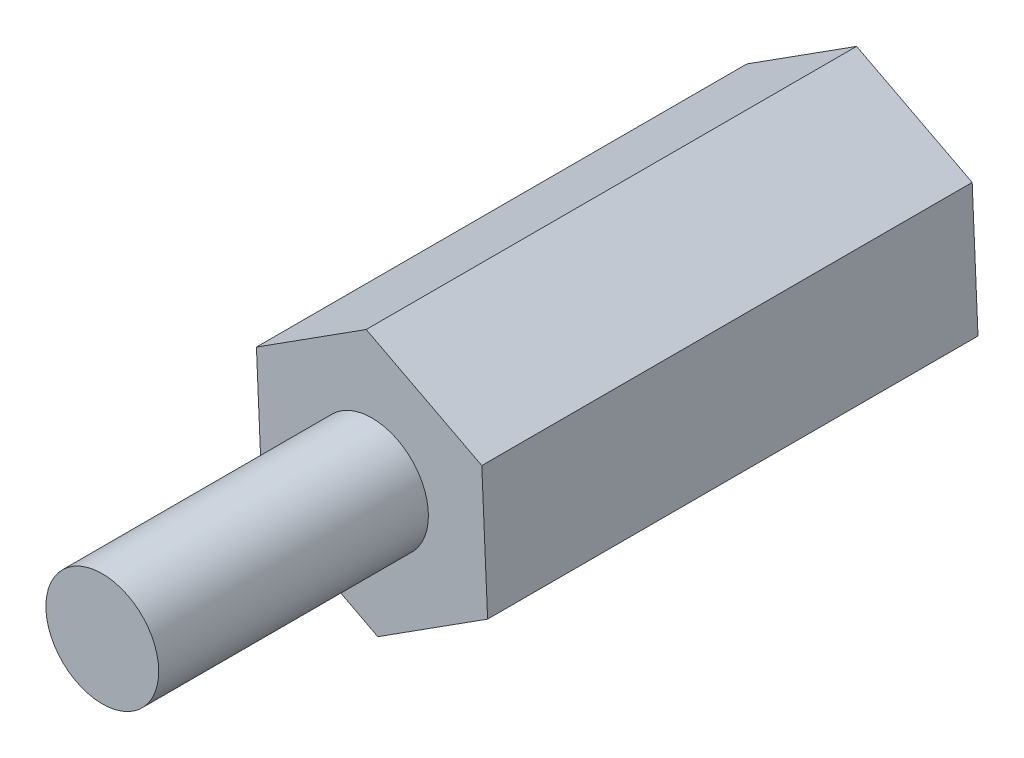
ISO-10303-21;
HEADER;
FILE_DESCRIPTION(('STEP AP214'),'2;1');
FILE_NAME('part.step','',(''),(''),'','','');
FILE_SCHEMA(('AUTOMOTIVE_DESIGN { 1 0 10303 214 1 1 1 1 }'));
ENDSEC;
DATA;
#1=APPLICATION_CONTEXT('core data for automotive mechanical design processes');
#2=APPLICATION_PROTOCOL_DEFINITION('international standard','automotive_design',2000,#1);
#3=PRODUCT_CONTEXT('',#1,'mechanical');
#4=PRODUCT('Part','Part','',(#3));
#5=PRODUCT_RELATED_PRODUCT_CATEGORY('part','',(#4));
#6=PRODUCT_DEFINITION_FORMATION('','',#4);
#7=PRODUCT_DEFINITION_CONTEXT('part definition',#1,'design');
#8=PRODUCT_DEFINITION('design','',#6,#7);
#9=PRODUCT_DEFINITION_SHAPE('','',#8);
#10=(LENGTH_UNIT() NAMED_UNIT(*) SI_UNIT(.MILLI.,.METRE.));
#11=(NAMED_UNIT(*) PLANE_ANGLE_UNIT() SI_UNIT($,.RADIAN.));
#12=(NAMED_UNIT(*) SI_UNIT($,.STERADIAN.) SOLID_ANGLE_UNIT());
#13=UNCERTAINTY_MEASURE_WITH_UNIT(LENGTH_MEASURE(1.E-05),#10,'distance_accuracy_value','');
#14=(GEOMETRIC_REPRESENTATION_CONTEXT(3) GLOBAL_UNCERTAINTY_ASSIGNED_CONTEXT((#13)) GLOBAL_UNIT_ASSIGNED_CONTEXT((#10,
#11,#12)) REPRESENTATION_CONTEXT('',''));
#15=CARTESIAN_POINT('',(0.,0.,0.));
#16=DIRECTION('',(0.,0.,1.));
#17=DIRECTION('',(1.,0.,0.));
#18=AXIS2_PLACEMENT_3D('',#15,#16,#17);
#19=CARTESIAN_POINT('',(0.,0.,15.5));
#20=DIRECTION('',(0.,0.,-1.));
#21=DIRECTION('',(-1.,0.,0.));
#22=AXIS2_PLACEMENT_3D('',#19,#20,#21);
#23=CYLINDRICAL_SURFACE('',#22,1.15);
#24=CARTESIAN_POINT('',(0.,0.,15.5));
#25=DIRECTION('',(0.,0.,1.));
#26=DIRECTION('',(1.,0.,0.));
#27=AXIS2_PLACEMENT_3D('',#24,#25,#26);
#28=CIRCLE('',#27,1.15);
#29=CARTESIAN_POINT('',(1.15,0.,15.5));
#30=VERTEX_POINT('',#29);
#31=EDGE_CURVE('E13',#30,#30,#28,.T.);
#32=ORIENTED_EDGE('',*,*,#31,.F.);
#33=EDGE_LOOP('',(#32));
#34=FACE_BOUND('',#33,.T.);
#35=CARTESIAN_POINT('',(0.,0.,10.));
#36=DIRECTION('',(0.,0.,1.));
#37=DIRECTION('',(1.,0.,0.));
#38=AXIS2_PLACEMENT_3D('',#35,#36,#37);
#39=CIRCLE('',#38,1.15);
#40=CARTESIAN_POINT('',(1.15,0.,10.));
#41=VERTEX_POINT('',#40);
#42=EDGE_CURVE('E57',#41,#41,#39,.T.);
#43=ORIENTED_EDGE('',*,*,#42,.T.);
#44=EDGE_LOOP('',(#43));
#45=FACE_BOUND('',#44,.T.);
#46=ADVANCED_FACE('F54',(#34,#45),#23,.T.);
#47=CARTESIAN_POINT('',(0.,0.,15.5));
#48=DIRECTION('',(0.,0.,1.));
#49=DIRECTION('',(1.,0.,0.));
#50=AXIS2_PLACEMENT_3D('',#47,#48,#49);
#51=PLANE('',#50);
#52=ORIENTED_EDGE('',*,*,#31,.T.);
#53=EDGE_LOOP('',(#52));
#54=FACE_BOUND('',#53,.T.);
#55=ADVANCED_FACE('F69',(#54),#51,.T.);
#56=CARTESIAN_POINT('',(0.,0.,10.));
#57=DIRECTION('',(0.,0.,1.));
#58=DIRECTION('',(1.,0.,0.));
#59=AXIS2_PLACEMENT_3D('',#56,#57,#58);
#60=PLANE('',#59);
#61=ORIENTED_EDGE('',*,*,#42,.F.);
#62=EDGE_LOOP('',(#61));
#63=FACE_BOUND('',#62,.T.);
#64=ADVANCED_FACE('F67',(#63),#60,.F.);
#65=CLOSED_SHELL('',(#46,#55,#64));
#66=MANIFOLD_SOLID_BREP('B2',#65);
#67=CARTESIAN_POINT('',(0.,0.,10.));
#68=DIRECTION('',(0.,0.,1.));
#69=DIRECTION('',(1.,0.,0.));
#70=AXIS2_PLACEMENT_3D('',#67,#68,#69);
#71=PLANE('',#70);
#72=DIRECTION('',(0.842825769233019,0.53818651294581,0.));
#73=VECTOR('',#72,1.);
#74=CARTESIAN_POINT('',(0.118635904858095,-2.65316016391999,10.));
#75=LINE('',#74,#73);
#76=CARTESIAN_POINT('',(0.118635904858095,-2.65316016391999,10.));
#77=VERTEX_POINT('',#76);
#78=CARTESIAN_POINT('',(2.35702205469264,-1.22383837455193,10.));
#79=VERTEX_POINT('',#78);
#80=EDGE_CURVE('E196',#77,#79,#75,.T.);
#81=ORIENTED_EDGE('',*,*,#80,.T.);
#82=DIRECTION('',(-0.0446703075687252,0.99900178359286,0.));
#83=VECTOR('',#82,1.);
#84=CARTESIAN_POINT('',(2.35702205469264,-1.22383837455193,10.));
#85=LINE('',#84,#83);
#86=CARTESIAN_POINT('',(2.23838614983454,1.42932178936806,10.));
#87=VERTEX_POINT('',#86);
#88=EDGE_CURVE('E154',#79,#87,#85,.T.);
#89=ORIENTED_EDGE('',*,*,#88,.T.);
#90=DIRECTION('',(-0.887496076801744,0.46081527064705,0.));
#91=VECTOR('',#90,1.);
#92=CARTESIAN_POINT('',(2.23838614983454,1.42932178936806,10.));
#93=LINE('',#92,#91);
#94=CARTESIAN_POINT('',(-0.118635904858095,2.65316016391998,10.));
#95=VERTEX_POINT('',#94);
#96=EDGE_CURVE('E167',#87,#95,#93,.T.);
#97=ORIENTED_EDGE('',*,*,#96,.T.);
#98=DIRECTION('',(-0.842825769233019,-0.53818651294581,0.));
#99=VECTOR('',#98,1.);
#100=CARTESIAN_POINT('',(-0.118635904858095,2.65316016391998,10.));
#101=LINE('',#100,#99);
#102=CARTESIAN_POINT('',(-2.35702205469264,1.22383837455192,10.));
#103=VERTEX_POINT('',#102);
#104=EDGE_CURVE('E161',#95,#103,#101,.T.);
#105=ORIENTED_EDGE('',*,*,#104,.T.);
#106=DIRECTION('',(0.0446703075687252,-0.99900178359286,0.));
#107=VECTOR('',#106,1.);
#108=CARTESIAN_POINT('',(-2.35702205469264,1.22383837455192,10.));
#109=LINE('',#108,#107);
#110=CARTESIAN_POINT('',(-2.23838614983454,-1.42932178936807,10.));
#111=VERTEX_POINT('',#110);
#112=EDGE_CURVE('E165',#103,#111,#109,.T.);
#113=ORIENTED_EDGE('',*,*,#112,.T.);
#114=DIRECTION('',(0.887496076801743,-0.46081527064705,0.));
#115=VECTOR('',#114,1.);
#116=CARTESIAN_POINT('',(-2.23838614983454,-1.42932178936807,10.));
#117=LINE('',#116,#115);
#118=EDGE_CURVE('E117',#111,#77,#117,.T.);
#119=ORIENTED_EDGE('',*,*,#118,.T.);
#120=EDGE_LOOP('',(#81,#89,#97,#105,#113,#119));
#121=FACE_BOUND('',#120,.T.);
#122=CARTESIAN_POINT('',(0.,0.,10.));
#123=DIRECTION('',(0.,0.,1.));
#124=DIRECTION('',(1.,0.,0.));
#125=AXIS2_PLACEMENT_3D('',#122,#123,#124);
#126=CIRCLE('',#125,1.15);
#127=CARTESIAN_POINT('',(1.15,0.,10.));
#128=VERTEX_POINT('',#127);
#129=EDGE_CURVE('E189',#128,#128,#126,.T.);
#130=ORIENTED_EDGE('',*,*,#129,.F.);
#131=EDGE_LOOP('',(#130));
#132=FACE_BOUND('',#131,.T.);
#133=ADVANCED_FACE('F100',(#121,#132),#71,.T.);
#134=CARTESIAN_POINT('',(0.,0.,0.));
#135=DIRECTION('',(0.,0.,1.));
#136=DIRECTION('',(1.,0.,0.));
#137=AXIS2_PLACEMENT_3D('',#134,#135,#136);
#138=PLANE('',#137);
#139=DIRECTION('',(0.842825769233019,0.53818651294581,0.));
#140=VECTOR('',#139,1.);
#141=CARTESIAN_POINT('',(0.118635904858095,-2.65316016391999,0.));
#142=LINE('',#141,#140);
#143=CARTESIAN_POINT('',(0.118635904858095,-2.65316016391999,0.));
#144=VERTEX_POINT('',#143);
#145=CARTESIAN_POINT('',(2.35702205469264,-1.22383837455193,0.));
#146=VERTEX_POINT('',#145);
#147=EDGE_CURVE('E185',#144,#146,#142,.T.);
#148=ORIENTED_EDGE('',*,*,#147,.F.);
#149=DIRECTION('',(0.887496076801743,-0.46081527064705,0.));
#150=VECTOR('',#149,1.);
#151=CARTESIAN_POINT('',(-2.23838614983454,-1.42932178936807,0.));
#152=LINE('',#151,#150);
#153=CARTESIAN_POINT('',(-2.23838614983454,-1.42932178936807,0.));
#154=VERTEX_POINT('',#153);
#155=EDGE_CURVE('E146',#154,#144,#152,.T.);
#156=ORIENTED_EDGE('',*,*,#155,.F.);
#157=DIRECTION('',(0.0446703075687252,-0.99900178359286,0.));
#158=VECTOR('',#157,1.);
#159=CARTESIAN_POINT('',(-2.35702205469264,1.22383837455192,0.));
#160=LINE('',#159,#158);
#161=CARTESIAN_POINT('',(-2.35702205469264,1.22383837455192,0.));
#162=VERTEX_POINT('',#161);
#163=EDGE_CURVE('E140',#162,#154,#160,.T.);
#164=ORIENTED_EDGE('',*,*,#163,.F.);
#165=DIRECTION('',(-0.842825769233019,-0.53818651294581,0.));
#166=VECTOR('',#165,1.);
#167=CARTESIAN_POINT('',(-0.118635904858095,2.65316016391998,0.));
#168=LINE('',#167,#166);
#169=CARTESIAN_POINT('',(-0.118635904858095,2.65316016391998,0.));
#170=VERTEX_POINT('',#169);
#171=EDGE_CURVE('E175',#170,#162,#168,.T.);
#172=ORIENTED_EDGE('',*,*,#171,.F.);
#173=DIRECTION('',(-0.887496076801744,0.46081527064705,0.));
#174=VECTOR('',#173,1.);
#175=CARTESIAN_POINT('',(2.23838614983454,1.42932178936806,0.));
#176=LINE('',#175,#174);
#177=CARTESIAN_POINT('',(2.23838614983454,1.42932178936806,0.));
#178=VERTEX_POINT('',#177);
#179=EDGE_CURVE('E191',#178,#170,#176,.T.);
#180=ORIENTED_EDGE('',*,*,#179,.F.);
#181=DIRECTION('',(-0.0446703075687252,0.99900178359286,0.));
#182=VECTOR('',#181,1.);
#183=CARTESIAN_POINT('',(2.35702205469264,-1.22383837455193,0.));
#184=LINE('',#183,#182);
#185=EDGE_CURVE('E188',#146,#178,#184,.T.);
#186=ORIENTED_EDGE('',*,*,#185,.F.);
#187=EDGE_LOOP('',(#148,#156,#164,#172,#180,#186));
#188=FACE_BOUND('',#187,.T.);
#189=CARTESIAN_POINT('',(0.,0.,0.));
#190=DIRECTION('',(0.,0.,1.));
#191=DIRECTION('',(1.,0.,0.));
#192=AXIS2_PLACEMENT_3D('',#189,#190,#191);
#193=CIRCLE('',#192,1.15);
#194=CARTESIAN_POINT('',(1.15,0.,0.));
#195=VERTEX_POINT('',#194);
#196=EDGE_CURVE('E289',#195,#195,#193,.T.);
#197=ORIENTED_EDGE('',*,*,#196,.T.);
#198=EDGE_LOOP('',(#197));
#199=FACE_BOUND('',#198,.T.);
#200=ADVANCED_FACE('F205',(#188,#199),#138,.F.);
#201=CARTESIAN_POINT('',(0.118635904858095,-2.65316016391999,10.));
#202=DIRECTION('',(-0.53818651294581,0.842825769233019,0.));
#203=DIRECTION('',(-0.842825769233019,-0.53818651294581,0.));
#204=AXIS2_PLACEMENT_3D('',#201,#202,#203);
#205=PLANE('',#204);
#206=ORIENTED_EDGE('',*,*,#147,.T.);
#207=DIRECTION('',(0.,0.,-1.));
#208=VECTOR('',#207,1.);
#209=CARTESIAN_POINT('',(2.35702205469264,-1.22383837455193,10.));
#210=LINE('',#209,#208);
#211=EDGE_CURVE('E52',#79,#146,#210,.T.);
#212=ORIENTED_EDGE('',*,*,#211,.F.);
#213=ORIENTED_EDGE('',*,*,#80,.F.);
#214=DIRECTION('',(0.,0.,-1.));
#215=VECTOR('',#214,1.);
#216=CARTESIAN_POINT('',(0.118635904858095,-2.65316016391999,10.));
#217=LINE('',#216,#215);
#218=EDGE_CURVE('E181',#77,#144,#217,.T.);
#219=ORIENTED_EDGE('',*,*,#218,.T.);
#220=EDGE_LOOP('',(#206,#212,#213,#219));
#221=FACE_BOUND('',#220,.T.);
#222=ADVANCED_FACE('F102',(#221),#205,.F.);
#223=CARTESIAN_POINT('',(2.35702205469264,-1.22383837455193,10.));
#224=DIRECTION('',(-0.99900178359286,-0.0446703075687252,0.));
#225=DIRECTION('',(0.0446703075687252,-0.99900178359286,0.));
#226=AXIS2_PLACEMENT_3D('',#223,#224,#225);
#227=PLANE('',#226);
#228=ORIENTED_EDGE('',*,*,#185,.T.);
#229=DIRECTION('',(0.,0.,-1.));
#230=VECTOR('',#229,1.);
#231=CARTESIAN_POINT('',(2.23838614983454,1.42932178936806,10.));
#232=LINE('',#231,#230);
#233=EDGE_CURVE('E109',#87,#178,#232,.T.);
#234=ORIENTED_EDGE('',*,*,#233,.F.);
#235=ORIENTED_EDGE('',*,*,#88,.F.);
#236=ORIENTED_EDGE('',*,*,#211,.T.);
#237=EDGE_LOOP('',(#228,#234,#235,#236));
#238=FACE_BOUND('',#237,.T.);
#239=ADVANCED_FACE('F230',(#238),#227,.F.);
#240=CARTESIAN_POINT('',(2.23838614983454,1.42932178936806,10.));
#241=DIRECTION('',(-0.46081527064705,-0.887496076801744,0.));
#242=DIRECTION('',(0.887496076801744,-0.46081527064705,0.));
#243=AXIS2_PLACEMENT_3D('',#240,#241,#242);
#244=PLANE('',#243);
#245=ORIENTED_EDGE('',*,*,#179,.T.);
#246=DIRECTION('',(0.,0.,-1.));
#247=VECTOR('',#246,1.);
#248=CARTESIAN_POINT('',(-0.118635904858095,2.65316016391998,10.));
#249=LINE('',#248,#247);
#250=EDGE_CURVE('E176',#95,#170,#249,.T.);
#251=ORIENTED_EDGE('',*,*,#250,.F.);
#252=ORIENTED_EDGE('',*,*,#96,.F.);
#253=ORIENTED_EDGE('',*,*,#233,.T.);
#254=EDGE_LOOP('',(#245,#251,#252,#253));
#255=FACE_BOUND('',#254,.T.);
#256=ADVANCED_FACE('F202',(#255),#244,.F.);
#257=CARTESIAN_POINT('',(-0.118635904858095,2.65316016391998,10.));
#258=DIRECTION('',(0.53818651294581,-0.842825769233019,0.));
#259=DIRECTION('',(0.842825769233019,0.53818651294581,0.));
#260=AXIS2_PLACEMENT_3D('',#257,#258,#259);
#261=PLANE('',#260);
#262=ORIENTED_EDGE('',*,*,#171,.T.);
#263=DIRECTION('',(0.,0.,-1.));
#264=VECTOR('',#263,1.);
#265=CARTESIAN_POINT('',(-2.35702205469264,1.22383837455192,10.));
#266=LINE('',#265,#264);
#267=EDGE_CURVE('E172',#103,#162,#266,.T.);
#268=ORIENTED_EDGE('',*,*,#267,.F.);
#269=ORIENTED_EDGE('',*,*,#104,.F.);
#270=ORIENTED_EDGE('',*,*,#250,.T.);
#271=EDGE_LOOP('',(#262,#268,#269,#270));
#272=FACE_BOUND('',#271,.T.);
#273=ADVANCED_FACE('F173',(#272),#261,.F.);
#274=CARTESIAN_POINT('',(-2.35702205469264,1.22383837455192,10.));
#275=DIRECTION('',(0.99900178359286,0.0446703075687252,0.));
#276=DIRECTION('',(-0.0446703075687252,0.99900178359286,0.));
#277=AXIS2_PLACEMENT_3D('',#274,#275,#276);
#278=PLANE('',#277);
#279=ORIENTED_EDGE('',*,*,#163,.T.);
#280=DIRECTION('',(0.,0.,-1.));
#281=VECTOR('',#280,1.);
#282=CARTESIAN_POINT('',(-2.23838614983454,-1.42932178936807,10.));
#283=LINE('',#282,#281);
#284=EDGE_CURVE('E177',#111,#154,#283,.T.);
#285=ORIENTED_EDGE('',*,*,#284,.F.);
#286=ORIENTED_EDGE('',*,*,#112,.F.);
#287=ORIENTED_EDGE('',*,*,#267,.T.);
#288=EDGE_LOOP('',(#279,#285,#286,#287));
#289=FACE_BOUND('',#288,.T.);
#290=ADVANCED_FACE('F179',(#289),#278,.F.);
#291=CARTESIAN_POINT('',(-2.23838614983454,-1.42932178936807,10.));
#292=DIRECTION('',(0.46081527064705,0.887496076801744,0.));
#293=DIRECTION('',(-0.887496076801744,0.46081527064705,0.));
#294=AXIS2_PLACEMENT_3D('',#291,#292,#293);
#295=PLANE('',#294);
#296=ORIENTED_EDGE('',*,*,#155,.T.);
#297=ORIENTED_EDGE('',*,*,#218,.F.);
#298=ORIENTED_EDGE('',*,*,#118,.F.);
#299=ORIENTED_EDGE('',*,*,#284,.T.);
#300=EDGE_LOOP('',(#296,#297,#298,#299));
#301=FACE_BOUND('',#300,.T.);
#302=ADVANCED_FACE('F210',(#301),#295,.F.);
#303=CARTESIAN_POINT('',(0.,0.,10.));
#304=DIRECTION('',(0.,0.,-1.));
#305=DIRECTION('',(-1.,0.,0.));
#306=AXIS2_PLACEMENT_3D('',#303,#304,#305);
#307=CYLINDRICAL_SURFACE('',#306,1.15);
#308=ORIENTED_EDGE('',*,*,#129,.T.);
#309=EDGE_LOOP('',(#308));
#310=FACE_BOUND('',#309,.T.);
#311=ORIENTED_EDGE('',*,*,#196,.F.);
#312=EDGE_LOOP('',(#311));
#313=FACE_BOUND('',#312,.T.);
#314=ADVANCED_FACE('F212',(#310,#313),#307,.F.);
#315=CLOSED_SHELL('',(#133,#200,#222,#239,#256,#273,#290,#302,#314));
#316=MANIFOLD_SOLID_BREP('B8',#315);
#317=ADVANCED_BREP_SHAPE_REPRESENTATION('',(#18,#66,#316),#14);
#318=SHAPE_DEFINITION_REPRESENTATION(#9,#317);
ENDSEC;
END-ISO-10303-21;
